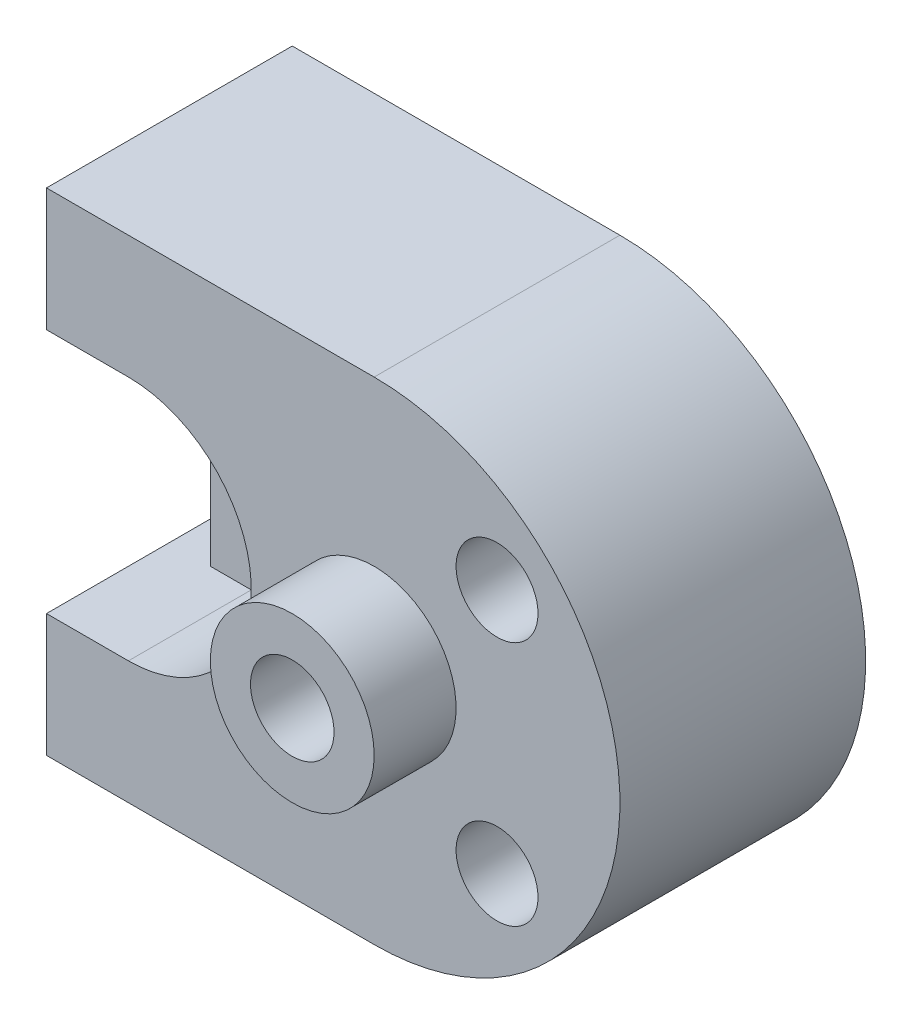
ISO-10303-21;
HEADER;
FILE_DESCRIPTION(('STEP AP214'),'2;1');
FILE_NAME('part.step','',(''),(''),'','','');
FILE_SCHEMA(('AUTOMOTIVE_DESIGN { 1 0 10303 214 1 1 1 1 }'));
ENDSEC;
DATA;
#1=APPLICATION_CONTEXT('core data for automotive mechanical design processes');
#2=APPLICATION_PROTOCOL_DEFINITION('international standard','automotive_design',2000,#1);
#3=PRODUCT_CONTEXT('',#1,'mechanical');
#4=PRODUCT('Part','Part','',(#3));
#5=PRODUCT_RELATED_PRODUCT_CATEGORY('part','',(#4));
#6=PRODUCT_DEFINITION_FORMATION('','',#4);
#7=PRODUCT_DEFINITION_CONTEXT('part definition',#1,'design');
#8=PRODUCT_DEFINITION('design','',#6,#7);
#9=PRODUCT_DEFINITION_SHAPE('','',#8);
#10=(LENGTH_UNIT() NAMED_UNIT(*) SI_UNIT(.MILLI.,.METRE.));
#11=(NAMED_UNIT(*) PLANE_ANGLE_UNIT() SI_UNIT($,.RADIAN.));
#12=(NAMED_UNIT(*) SI_UNIT($,.STERADIAN.) SOLID_ANGLE_UNIT());
#13=UNCERTAINTY_MEASURE_WITH_UNIT(LENGTH_MEASURE(1.E-05),#10,'distance_accuracy_value','');
#14=(GEOMETRIC_REPRESENTATION_CONTEXT(3) GLOBAL_UNCERTAINTY_ASSIGNED_CONTEXT((#13)) GLOBAL_UNIT_ASSIGNED_CONTEXT((#10,
#11,#12)) REPRESENTATION_CONTEXT('',''));
#15=CARTESIAN_POINT('',(0.,0.,0.));
#16=DIRECTION('',(0.,0.,1.));
#17=DIRECTION('',(1.,0.,0.));
#18=AXIS2_PLACEMENT_3D('',#15,#16,#17);
#19=CARTESIAN_POINT('',(0.,0.,30.));
#20=DIRECTION('',(0.,0.,-1.));
#21=DIRECTION('',(-1.,0.,0.));
#22=AXIS2_PLACEMENT_3D('',#19,#20,#21);
#23=PLANE('',#22);
#24=CARTESIAN_POINT('',(15.,-15.,30.));
#25=DIRECTION('',(0.,0.,1.));
#26=DIRECTION('',(1.,0.,0.));
#27=AXIS2_PLACEMENT_3D('',#24,#25,#26);
#28=CIRCLE('',#27,5.);
#29=CARTESIAN_POINT('',(20.,-15.,30.));
#30=VERTEX_POINT('',#29);
#31=EDGE_CURVE('E156',#30,#30,#28,.T.);
#32=ORIENTED_EDGE('',*,*,#31,.F.);
#33=EDGE_LOOP('',(#32));
#34=FACE_BOUND('',#33,.T.);
#35=CARTESIAN_POINT('',(15.,15.,30.));
#36=DIRECTION('',(0.,0.,1.));
#37=DIRECTION('',(1.,0.,0.));
#38=AXIS2_PLACEMENT_3D('',#35,#36,#37);
#39=CIRCLE('',#38,5.);
#40=CARTESIAN_POINT('',(20.,15.,30.));
#41=VERTEX_POINT('',#40);
#42=EDGE_CURVE('E160',#41,#41,#39,.T.);
#43=ORIENTED_EDGE('',*,*,#42,.F.);
#44=EDGE_LOOP('',(#43));
#45=FACE_BOUND('',#44,.T.);
#46=DIRECTION('',(1.,0.,0.));
#47=VECTOR('',#46,1.);
#48=CARTESIAN_POINT('',(-40.,15.,30.));
#49=LINE('',#48,#47);
#50=CARTESIAN_POINT('',(-40.,15.,30.));
#51=VERTEX_POINT('',#50);
#52=CARTESIAN_POINT('',(-30.,15.,30.));
#53=VERTEX_POINT('',#52);
#54=EDGE_CURVE('E209',#51,#53,#49,.T.);
#55=ORIENTED_EDGE('',*,*,#54,.T.);
#56=CARTESIAN_POINT('',(-30.,-1.7110534492634E-08,30.));
#57=DIRECTION('',(0.,0.,1.));
#58=DIRECTION('',(-1.,0.,0.));
#59=AXIS2_PLACEMENT_3D('',#56,#57,#58);
#60=CIRCLE('',#59,15.0000000171105);
#61=CARTESIAN_POINT('',(-29.9989867714367,-15.,30.));
#62=VERTEX_POINT('',#61);
#63=EDGE_CURVE('E177',#62,#53,#60,.T.);
#64=ORIENTED_EDGE('',*,*,#63,.F.);
#65=DIRECTION('',(-1.,0.,0.));
#66=VECTOR('',#65,1.);
#67=CARTESIAN_POINT('',(-30.,-15.,30.));
#68=LINE('',#67,#66);
#69=CARTESIAN_POINT('',(-40.,-15.,30.));
#70=VERTEX_POINT('',#69);
#71=EDGE_CURVE('E211',#62,#70,#68,.T.);
#72=ORIENTED_EDGE('',*,*,#71,.T.);
#73=DIRECTION('',(0.,-1.,0.));
#74=VECTOR('',#73,1.);
#75=CARTESIAN_POINT('',(-40.,-15.,30.));
#76=LINE('',#75,#74);
#77=CARTESIAN_POINT('',(-40.,-30.,30.));
#78=VERTEX_POINT('',#77);
#79=EDGE_CURVE('E213',#70,#78,#76,.T.);
#80=ORIENTED_EDGE('',*,*,#79,.T.);
#81=DIRECTION('',(1.,0.,0.));
#82=VECTOR('',#81,1.);
#83=CARTESIAN_POINT('',(-40.,-30.,30.));
#84=LINE('',#83,#82);
#85=CARTESIAN_POINT('',(0.,-30.,30.));
#86=VERTEX_POINT('',#85);
#87=EDGE_CURVE('E215',#78,#86,#84,.T.);
#88=ORIENTED_EDGE('',*,*,#87,.T.);
#89=CARTESIAN_POINT('',(0.,0.,30.));
#90=DIRECTION('',(0.,0.,1.));
#91=DIRECTION('',(-1.,0.,0.));
#92=AXIS2_PLACEMENT_3D('',#89,#90,#91);
#93=CIRCLE('',#92,30.);
#94=CARTESIAN_POINT('',(0.,30.,30.));
#95=VERTEX_POINT('',#94);
#96=EDGE_CURVE('E217',#86,#95,#93,.T.);
#97=ORIENTED_EDGE('',*,*,#96,.T.);
#98=DIRECTION('',(-1.,0.,0.));
#99=VECTOR('',#98,1.);
#100=CARTESIAN_POINT('',(-40.,30.,30.));
#101=LINE('',#100,#99);
#102=CARTESIAN_POINT('',(-40.,30.,30.));
#103=VERTEX_POINT('',#102);
#104=EDGE_CURVE('E203',#95,#103,#101,.T.);
#105=ORIENTED_EDGE('',*,*,#104,.T.);
#106=DIRECTION('',(0.,-1.,0.));
#107=VECTOR('',#106,1.);
#108=CARTESIAN_POINT('',(-40.,30.,30.));
#109=LINE('',#108,#107);
#110=EDGE_CURVE('E206',#103,#51,#109,.T.);
#111=ORIENTED_EDGE('',*,*,#110,.T.);
#112=EDGE_LOOP('',(#55,#64,#72,#80,#88,#97,#105,#111));
#113=FACE_BOUND('',#112,.T.);
#114=CARTESIAN_POINT('',(0.,0.,30.));
#115=DIRECTION('',(0.,0.,-1.));
#116=DIRECTION('',(-1.,0.,0.));
#117=AXIS2_PLACEMENT_3D('',#114,#115,#116);
#118=CIRCLE('',#117,10.);
#119=CARTESIAN_POINT('',(-10.,0.,30.));
#120=VERTEX_POINT('',#119);
#121=EDGE_CURVE('E11',#120,#120,#118,.F.);
#122=ORIENTED_EDGE('',*,*,#121,.F.);
#123=EDGE_LOOP('',(#122));
#124=FACE_BOUND('',#123,.T.);
#125=ADVANCED_FACE('F35',(#34,#45,#113,#124),#23,.F.);
#126=CARTESIAN_POINT('',(-40.,30.,30.));
#127=DIRECTION('',(0.,-1.,0.));
#128=DIRECTION('',(0.,0.,-1.));
#129=AXIS2_PLACEMENT_3D('',#126,#127,#128);
#130=PLANE('',#129);
#131=DIRECTION('',(-1.,0.,0.));
#132=VECTOR('',#131,1.);
#133=CARTESIAN_POINT('',(-40.,30.,0.));
#134=LINE('',#133,#132);
#135=CARTESIAN_POINT('',(0.,30.,0.));
#136=VERTEX_POINT('',#135);
#137=CARTESIAN_POINT('',(-40.,30.,0.));
#138=VERTEX_POINT('',#137);
#139=EDGE_CURVE('E201',#136,#138,#134,.T.);
#140=ORIENTED_EDGE('',*,*,#139,.T.);
#141=DIRECTION('',(0.,0.,-1.));
#142=VECTOR('',#141,1.);
#143=CARTESIAN_POINT('',(-40.,30.,30.));
#144=LINE('',#143,#142);
#145=EDGE_CURVE('E43',#103,#138,#144,.T.);
#146=ORIENTED_EDGE('',*,*,#145,.F.);
#147=ORIENTED_EDGE('',*,*,#104,.F.);
#148=DIRECTION('',(0.,0.,-1.));
#149=VECTOR('',#148,1.);
#150=CARTESIAN_POINT('',(0.,30.,30.));
#151=LINE('',#150,#149);
#152=EDGE_CURVE('E219',#95,#136,#151,.T.);
#153=ORIENTED_EDGE('',*,*,#152,.T.);
#154=EDGE_LOOP('',(#140,#146,#147,#153));
#155=FACE_BOUND('',#154,.T.);
#156=ADVANCED_FACE('F37',(#155),#130,.F.);
#157=CARTESIAN_POINT('',(-40.,30.,30.));
#158=DIRECTION('',(1.,0.,0.));
#159=DIRECTION('',(0.,1.,0.));
#160=AXIS2_PLACEMENT_3D('',#157,#158,#159);
#161=PLANE('',#160);
#162=DIRECTION('',(0.,-1.,0.));
#163=VECTOR('',#162,1.);
#164=CARTESIAN_POINT('',(-40.,30.,0.));
#165=LINE('',#164,#163);
#166=CARTESIAN_POINT('',(-40.,15.,0.));
#167=VERTEX_POINT('',#166);
#168=EDGE_CURVE('E222',#138,#167,#165,.T.);
#169=ORIENTED_EDGE('',*,*,#168,.T.);
#170=DIRECTION('',(0.,0.,-1.));
#171=VECTOR('',#170,1.);
#172=CARTESIAN_POINT('',(-40.,15.,30.));
#173=LINE('',#172,#171);
#174=EDGE_CURVE('E243',#51,#167,#173,.T.);
#175=ORIENTED_EDGE('',*,*,#174,.F.);
#176=ORIENTED_EDGE('',*,*,#110,.F.);
#177=ORIENTED_EDGE('',*,*,#145,.T.);
#178=EDGE_LOOP('',(#169,#175,#176,#177));
#179=FACE_BOUND('',#178,.T.);
#180=ADVANCED_FACE('F247',(#179),#161,.F.);
#181=CARTESIAN_POINT('',(-40.,15.,30.));
#182=DIRECTION('',(0.,1.,0.));
#183=DIRECTION('',(-1.,0.,0.));
#184=AXIS2_PLACEMENT_3D('',#181,#182,#183);
#185=PLANE('',#184);
#186=DIRECTION('',(1.,0.,0.));
#187=VECTOR('',#186,1.);
#188=CARTESIAN_POINT('',(-40.,15.,0.));
#189=LINE('',#188,#187);
#190=CARTESIAN_POINT('',(-35.,15.,0.));
#191=VERTEX_POINT('',#190);
#192=EDGE_CURVE('E58',#167,#191,#189,.T.);
#193=ORIENTED_EDGE('',*,*,#192,.T.);
#194=DIRECTION('',(0.,0.,1.));
#195=VECTOR('',#194,1.);
#196=CARTESIAN_POINT('',(-35.,15.,0.));
#197=LINE('',#196,#195);
#198=CARTESIAN_POINT('',(-35.,15.,15.));
#199=VERTEX_POINT('',#198);
#200=EDGE_CURVE('E197',#191,#199,#197,.T.);
#201=ORIENTED_EDGE('',*,*,#200,.T.);
#202=DIRECTION('',(-1.,0.,0.));
#203=VECTOR('',#202,1.);
#204=CARTESIAN_POINT('',(-35.,15.,15.));
#205=LINE('',#204,#203);
#206=CARTESIAN_POINT('',(-30.,15.,15.));
#207=VERTEX_POINT('',#206);
#208=EDGE_CURVE('E50',#207,#199,#205,.T.);
#209=ORIENTED_EDGE('',*,*,#208,.F.);
#210=DIRECTION('',(0.,0.,1.));
#211=VECTOR('',#210,1.);
#212=CARTESIAN_POINT('',(-30.,15.,15.));
#213=LINE('',#212,#211);
#214=EDGE_CURVE('E189',#207,#53,#213,.T.);
#215=ORIENTED_EDGE('',*,*,#214,.T.);
#216=ORIENTED_EDGE('',*,*,#54,.F.);
#217=ORIENTED_EDGE('',*,*,#174,.T.);
#218=EDGE_LOOP('',(#193,#201,#209,#215,#216,#217));
#219=FACE_BOUND('',#218,.T.);
#220=ADVANCED_FACE('F262',(#219),#185,.F.);
#221=CARTESIAN_POINT('',(-30.,-15.,30.));
#222=DIRECTION('',(0.,-1.,0.));
#223=DIRECTION('',(1.,0.,0.));
#224=AXIS2_PLACEMENT_3D('',#221,#222,#223);
#225=PLANE('',#224);
#226=ORIENTED_EDGE('',*,*,#71,.F.);
#227=DIRECTION('',(0.,0.,1.));
#228=VECTOR('',#227,1.);
#229=CARTESIAN_POINT('',(-29.9989867714367,-15.,15.));
#230=LINE('',#229,#228);
#231=CARTESIAN_POINT('',(-29.9989867714367,-15.,15.));
#232=VERTEX_POINT('',#231);
#233=EDGE_CURVE('E186',#232,#62,#230,.T.);
#234=ORIENTED_EDGE('',*,*,#233,.F.);
#235=DIRECTION('',(1.,0.,0.));
#236=VECTOR('',#235,1.);
#237=CARTESIAN_POINT('',(-35.,-15.,15.));
#238=LINE('',#237,#236);
#239=CARTESIAN_POINT('',(-35.,-15.,15.));
#240=VERTEX_POINT('',#239);
#241=EDGE_CURVE('E180',#240,#232,#238,.T.);
#242=ORIENTED_EDGE('',*,*,#241,.F.);
#243=DIRECTION('',(0.,0.,1.));
#244=VECTOR('',#243,1.);
#245=CARTESIAN_POINT('',(-35.,-15.,0.));
#246=LINE('',#245,#244);
#247=CARTESIAN_POINT('',(-35.,-15.,0.));
#248=VERTEX_POINT('',#247);
#249=EDGE_CURVE('E198',#248,#240,#246,.T.);
#250=ORIENTED_EDGE('',*,*,#249,.F.);
#251=DIRECTION('',(-1.,0.,0.));
#252=VECTOR('',#251,1.);
#253=CARTESIAN_POINT('',(-30.,-15.,0.));
#254=LINE('',#253,#252);
#255=CARTESIAN_POINT('',(-40.,-15.,0.));
#256=VERTEX_POINT('',#255);
#257=EDGE_CURVE('E225',#248,#256,#254,.T.);
#258=ORIENTED_EDGE('',*,*,#257,.T.);
#259=DIRECTION('',(0.,0.,-1.));
#260=VECTOR('',#259,1.);
#261=CARTESIAN_POINT('',(-40.,-15.,30.));
#262=LINE('',#261,#260);
#263=EDGE_CURVE('E240',#70,#256,#262,.T.);
#264=ORIENTED_EDGE('',*,*,#263,.F.);
#265=EDGE_LOOP('',(#226,#234,#242,#250,#258,#264));
#266=FACE_BOUND('',#265,.T.);
#267=ADVANCED_FACE('F283',(#266),#225,.F.);
#268=CARTESIAN_POINT('',(-40.,-15.,30.));
#269=DIRECTION('',(1.,0.,0.));
#270=DIRECTION('',(0.,1.,0.));
#271=AXIS2_PLACEMENT_3D('',#268,#269,#270);
#272=PLANE('',#271);
#273=DIRECTION('',(0.,-1.,0.));
#274=VECTOR('',#273,1.);
#275=CARTESIAN_POINT('',(-40.,-15.,0.));
#276=LINE('',#275,#274);
#277=CARTESIAN_POINT('',(-40.,-30.,0.));
#278=VERTEX_POINT('',#277);
#279=EDGE_CURVE('E227',#256,#278,#276,.T.);
#280=ORIENTED_EDGE('',*,*,#279,.T.);
#281=DIRECTION('',(0.,0.,-1.));
#282=VECTOR('',#281,1.);
#283=CARTESIAN_POINT('',(-40.,-30.,30.));
#284=LINE('',#283,#282);
#285=EDGE_CURVE('E237',#78,#278,#284,.T.);
#286=ORIENTED_EDGE('',*,*,#285,.F.);
#287=ORIENTED_EDGE('',*,*,#79,.F.);
#288=ORIENTED_EDGE('',*,*,#263,.T.);
#289=EDGE_LOOP('',(#280,#286,#287,#288));
#290=FACE_BOUND('',#289,.T.);
#291=ADVANCED_FACE('F280',(#290),#272,.F.);
#292=CARTESIAN_POINT('',(-40.,-30.,30.));
#293=DIRECTION('',(0.,1.,0.));
#294=DIRECTION('',(0.,0.,1.));
#295=AXIS2_PLACEMENT_3D('',#292,#293,#294);
#296=PLANE('',#295);
#297=DIRECTION('',(1.,0.,0.));
#298=VECTOR('',#297,1.);
#299=CARTESIAN_POINT('',(-40.,-30.,0.));
#300=LINE('',#299,#298);
#301=CARTESIAN_POINT('',(0.,-30.,0.));
#302=VERTEX_POINT('',#301);
#303=EDGE_CURVE('E229',#278,#302,#300,.T.);
#304=ORIENTED_EDGE('',*,*,#303,.T.);
#305=DIRECTION('',(0.,0.,-1.));
#306=VECTOR('',#305,1.);
#307=CARTESIAN_POINT('',(0.,-30.,30.));
#308=LINE('',#307,#306);
#309=EDGE_CURVE('E234',#86,#302,#308,.T.);
#310=ORIENTED_EDGE('',*,*,#309,.F.);
#311=ORIENTED_EDGE('',*,*,#87,.F.);
#312=ORIENTED_EDGE('',*,*,#285,.T.);
#313=EDGE_LOOP('',(#304,#310,#311,#312));
#314=FACE_BOUND('',#313,.T.);
#315=ADVANCED_FACE('F277',(#314),#296,.F.);
#316=CARTESIAN_POINT('',(0.,0.,30.));
#317=DIRECTION('',(0.,0.,-1.));
#318=DIRECTION('',(-1.,0.,0.));
#319=AXIS2_PLACEMENT_3D('',#316,#317,#318);
#320=CYLINDRICAL_SURFACE('',#319,30.);
#321=CARTESIAN_POINT('',(0.,0.,0.));
#322=DIRECTION('',(0.,0.,1.));
#323=DIRECTION('',(-1.,0.,0.));
#324=AXIS2_PLACEMENT_3D('',#321,#322,#323);
#325=CIRCLE('',#324,30.);
#326=EDGE_CURVE('E207',#302,#136,#325,.T.);
#327=ORIENTED_EDGE('',*,*,#326,.T.);
#328=ORIENTED_EDGE('',*,*,#152,.F.);
#329=ORIENTED_EDGE('',*,*,#96,.F.);
#330=ORIENTED_EDGE('',*,*,#309,.T.);
#331=EDGE_LOOP('',(#327,#328,#329,#330));
#332=FACE_BOUND('',#331,.T.);
#333=ADVANCED_FACE('F275',(#332),#320,.T.);
#334=CARTESIAN_POINT('',(0.,0.,0.));
#335=DIRECTION('',(0.,0.,-1.));
#336=DIRECTION('',(-1.,0.,0.));
#337=AXIS2_PLACEMENT_3D('',#334,#335,#336);
#338=PLANE('',#337);
#339=CARTESIAN_POINT('',(15.,15.,0.));
#340=DIRECTION('',(0.,0.,-1.));
#341=DIRECTION('',(-1.,0.,0.));
#342=AXIS2_PLACEMENT_3D('',#339,#340,#341);
#343=CIRCLE('',#342,5.);
#344=CARTESIAN_POINT('',(10.,15.,0.));
#345=VERTEX_POINT('',#344);
#346=EDGE_CURVE('E140',#345,#345,#343,.T.);
#347=ORIENTED_EDGE('',*,*,#346,.F.);
#348=EDGE_LOOP('',(#347));
#349=FACE_BOUND('',#348,.T.);
#350=CARTESIAN_POINT('',(15.,-15.,0.));
#351=DIRECTION('',(0.,0.,-1.));
#352=DIRECTION('',(-1.,0.,0.));
#353=AXIS2_PLACEMENT_3D('',#350,#351,#352);
#354=CIRCLE('',#353,5.);
#355=CARTESIAN_POINT('',(10.,-15.,0.));
#356=VERTEX_POINT('',#355);
#357=EDGE_CURVE('E127',#356,#356,#354,.T.);
#358=ORIENTED_EDGE('',*,*,#357,.F.);
#359=EDGE_LOOP('',(#358));
#360=FACE_BOUND('',#359,.T.);
#361=CARTESIAN_POINT('',(-25.,0.,0.));
#362=DIRECTION('',(0.,0.,-1.));
#363=DIRECTION('',(-1.,0.,0.));
#364=AXIS2_PLACEMENT_3D('',#361,#362,#363);
#365=CIRCLE('',#364,5.);
#366=CARTESIAN_POINT('',(-30.,0.,0.));
#367=VERTEX_POINT('',#366);
#368=EDGE_CURVE('E174',#367,#367,#365,.T.);
#369=ORIENTED_EDGE('',*,*,#368,.F.);
#370=EDGE_LOOP('',(#369));
#371=FACE_BOUND('',#370,.T.);
#372=ORIENTED_EDGE('',*,*,#257,.F.);
#373=DIRECTION('',(0.,-1.,0.));
#374=VECTOR('',#373,1.);
#375=CARTESIAN_POINT('',(-35.,-15.,0.));
#376=LINE('',#375,#374);
#377=EDGE_CURVE('E192',#191,#248,#376,.T.);
#378=ORIENTED_EDGE('',*,*,#377,.F.);
#379=ORIENTED_EDGE('',*,*,#192,.F.);
#380=ORIENTED_EDGE('',*,*,#168,.F.);
#381=ORIENTED_EDGE('',*,*,#139,.F.);
#382=ORIENTED_EDGE('',*,*,#326,.F.);
#383=ORIENTED_EDGE('',*,*,#303,.F.);
#384=ORIENTED_EDGE('',*,*,#279,.F.);
#385=EDGE_LOOP('',(#372,#378,#379,#380,#381,#382,#383,#384));
#386=FACE_BOUND('',#385,.T.);
#387=ADVANCED_FACE('F256',(#349,#360,#371,#386),#338,.T.);
#388=CARTESIAN_POINT('',(-35.,-15.,0.));
#389=DIRECTION('',(-1.,0.,0.));
#390=DIRECTION('',(0.,0.,1.));
#391=AXIS2_PLACEMENT_3D('',#388,#389,#390);
#392=PLANE('',#391);
#393=DIRECTION('',(0.,-1.,0.));
#394=VECTOR('',#393,1.);
#395=CARTESIAN_POINT('',(-35.,-15.,15.));
#396=LINE('',#395,#394);
#397=EDGE_CURVE('E178',#199,#240,#396,.T.);
#398=ORIENTED_EDGE('',*,*,#397,.F.);
#399=ORIENTED_EDGE('',*,*,#200,.F.);
#400=ORIENTED_EDGE('',*,*,#377,.T.);
#401=ORIENTED_EDGE('',*,*,#249,.T.);
#402=EDGE_LOOP('',(#398,#399,#400,#401));
#403=FACE_BOUND('',#402,.T.);
#404=ADVANCED_FACE('F261',(#403),#392,.T.);
#405=CARTESIAN_POINT('',(-30.,-1.7110534492634E-08,15.));
#406=DIRECTION('',(0.,0.,1.));
#407=DIRECTION('',(1.,0.,0.));
#408=AXIS2_PLACEMENT_3D('',#405,#406,#407);
#409=CYLINDRICAL_SURFACE('',#408,15.0000000171105);
#410=ORIENTED_EDGE('',*,*,#63,.T.);
#411=ORIENTED_EDGE('',*,*,#214,.F.);
#412=CARTESIAN_POINT('',(-30.,-1.7110534492634E-08,15.));
#413=DIRECTION('',(0.,0.,1.));
#414=DIRECTION('',(-1.,0.,0.));
#415=AXIS2_PLACEMENT_3D('',#412,#413,#414);
#416=CIRCLE('',#415,15.0000000171105);
#417=EDGE_CURVE('E183',#232,#207,#416,.T.);
#418=ORIENTED_EDGE('',*,*,#417,.F.);
#419=ORIENTED_EDGE('',*,*,#233,.T.);
#420=EDGE_LOOP('',(#410,#411,#418,#419));
#421=FACE_BOUND('',#420,.T.);
#422=ADVANCED_FACE('F267',(#421),#409,.F.);
#423=CARTESIAN_POINT('',(-30.,-1.7110534492634E-08,15.));
#424=DIRECTION('',(0.,0.,-1.));
#425=DIRECTION('',(-1.,0.,0.));
#426=AXIS2_PLACEMENT_3D('',#423,#424,#425);
#427=PLANE('',#426);
#428=CARTESIAN_POINT('',(-25.,0.,15.));
#429=DIRECTION('',(0.,0.,1.));
#430=DIRECTION('',(1.,0.,0.));
#431=AXIS2_PLACEMENT_3D('',#428,#429,#430);
#432=CIRCLE('',#431,5.);
#433=CARTESIAN_POINT('',(-20.,0.,15.));
#434=VERTEX_POINT('',#433);
#435=EDGE_CURVE('E171',#434,#434,#432,.T.);
#436=ORIENTED_EDGE('',*,*,#435,.F.);
#437=EDGE_LOOP('',(#436));
#438=FACE_BOUND('',#437,.T.);
#439=ORIENTED_EDGE('',*,*,#397,.T.);
#440=ORIENTED_EDGE('',*,*,#241,.T.);
#441=ORIENTED_EDGE('',*,*,#417,.T.);
#442=ORIENTED_EDGE('',*,*,#208,.T.);
#443=EDGE_LOOP('',(#439,#440,#441,#442));
#444=FACE_BOUND('',#443,.T.);
#445=ADVANCED_FACE('F284',(#438,#444),#427,.F.);
#446=CARTESIAN_POINT('',(-25.,0.,-20.));
#447=DIRECTION('',(0.,0.,1.));
#448=DIRECTION('',(1.,0.,0.));
#449=AXIS2_PLACEMENT_3D('',#446,#447,#448);
#450=CYLINDRICAL_SURFACE('',#449,5.);
#451=ORIENTED_EDGE('',*,*,#368,.T.);
#452=EDGE_LOOP('',(#451));
#453=FACE_BOUND('',#452,.T.);
#454=ORIENTED_EDGE('',*,*,#435,.T.);
#455=EDGE_LOOP('',(#454));
#456=FACE_BOUND('',#455,.T.);
#457=ADVANCED_FACE('F286',(#453,#456),#450,.F.);
#458=CARTESIAN_POINT('',(0.,0.,40.));
#459=DIRECTION('',(0.,0.,-1.));
#460=DIRECTION('',(-1.,0.,0.));
#461=AXIS2_PLACEMENT_3D('',#458,#459,#460);
#462=CYLINDRICAL_SURFACE('',#461,10.);
#463=CARTESIAN_POINT('',(0.,0.,40.));
#464=DIRECTION('',(0.,0.,1.));
#465=DIRECTION('',(1.,0.,0.));
#466=AXIS2_PLACEMENT_3D('',#463,#464,#465);
#467=CIRCLE('',#466,10.);
#468=CARTESIAN_POINT('',(10.,0.,40.));
#469=VERTEX_POINT('',#468);
#470=EDGE_CURVE('E166',#469,#469,#467,.T.);
#471=ORIENTED_EDGE('',*,*,#470,.F.);
#472=EDGE_LOOP('',(#471));
#473=FACE_BOUND('',#472,.T.);
#474=ORIENTED_EDGE('',*,*,#121,.T.);
#475=EDGE_LOOP('',(#474));
#476=FACE_BOUND('',#475,.T.);
#477=ADVANCED_FACE('F293',(#473,#476),#462,.T.);
#478=CARTESIAN_POINT('',(0.,0.,40.));
#479=DIRECTION('',(0.,0.,1.));
#480=DIRECTION('',(1.,0.,0.));
#481=AXIS2_PLACEMENT_3D('',#478,#479,#480);
#482=PLANE('',#481);
#483=CARTESIAN_POINT('',(0.,0.,40.));
#484=DIRECTION('',(0.,0.,1.));
#485=DIRECTION('',(1.,0.,0.));
#486=AXIS2_PLACEMENT_3D('',#483,#484,#485);
#487=CIRCLE('',#486,5.1);
#488=CARTESIAN_POINT('',(5.1,0.,40.));
#489=VERTEX_POINT('',#488);
#490=EDGE_CURVE('E128',#489,#489,#487,.T.);
#491=ORIENTED_EDGE('',*,*,#490,.F.);
#492=EDGE_LOOP('',(#491));
#493=FACE_BOUND('',#492,.T.);
#494=ORIENTED_EDGE('',*,*,#470,.T.);
#495=EDGE_LOOP('',(#494));
#496=FACE_BOUND('',#495,.T.);
#497=ADVANCED_FACE('F379',(#493,#496),#482,.T.);
#498=CARTESIAN_POINT('',(15.,15.,20.));
#499=DIRECTION('',(0.,0.,1.));
#500=DIRECTION('',(1.,0.,0.));
#501=AXIS2_PLACEMENT_3D('',#498,#499,#500);
#502=CYLINDRICAL_SURFACE('',#501,5.);
#503=CARTESIAN_POINT('',(15.,15.,20.));
#504=DIRECTION('',(0.,0.,1.));
#505=DIRECTION('',(1.,0.,0.));
#506=AXIS2_PLACEMENT_3D('',#503,#504,#505);
#507=CIRCLE('',#506,5.);
#508=CARTESIAN_POINT('',(20.,15.,20.));
#509=VERTEX_POINT('',#508);
#510=EDGE_CURVE('E163',#509,#509,#507,.T.);
#511=ORIENTED_EDGE('',*,*,#510,.F.);
#512=EDGE_LOOP('',(#511));
#513=FACE_BOUND('',#512,.T.);
#514=ORIENTED_EDGE('',*,*,#42,.T.);
#515=EDGE_LOOP('',(#514));
#516=FACE_BOUND('',#515,.T.);
#517=ADVANCED_FACE('F392',(#513,#516),#502,.F.);
#518=CARTESIAN_POINT('',(15.,15.,20.));
#519=DIRECTION('',(0.,0.,1.));
#520=DIRECTION('',(1.,0.,0.));
#521=AXIS2_PLACEMENT_3D('',#518,#519,#520);
#522=PLANE('',#521);
#523=CARTESIAN_POINT('',(15.,15.,20.));
#524=DIRECTION('',(0.,0.,1.));
#525=DIRECTION('',(1.,0.,0.));
#526=AXIS2_PLACEMENT_3D('',#523,#524,#525);
#527=CIRCLE('',#526,2.5);
#528=CARTESIAN_POINT('',(17.5,15.,20.));
#529=VERTEX_POINT('',#528);
#530=EDGE_CURVE('E151',#529,#529,#527,.T.);
#531=ORIENTED_EDGE('',*,*,#530,.F.);
#532=EDGE_LOOP('',(#531));
#533=FACE_BOUND('',#532,.T.);
#534=ORIENTED_EDGE('',*,*,#510,.T.);
#535=EDGE_LOOP('',(#534));
#536=FACE_BOUND('',#535,.T.);
#537=ADVANCED_FACE('F397',(#533,#536),#522,.T.);
#538=CARTESIAN_POINT('',(15.,-15.,20.));
#539=DIRECTION('',(0.,0.,1.));
#540=DIRECTION('',(1.,0.,0.));
#541=AXIS2_PLACEMENT_3D('',#538,#539,#540);
#542=CYLINDRICAL_SURFACE('',#541,5.);
#543=CARTESIAN_POINT('',(15.,-15.,20.));
#544=DIRECTION('',(0.,0.,1.));
#545=DIRECTION('',(1.,0.,0.));
#546=AXIS2_PLACEMENT_3D('',#543,#544,#545);
#547=CIRCLE('',#546,5.);
#548=CARTESIAN_POINT('',(20.,-15.,20.));
#549=VERTEX_POINT('',#548);
#550=EDGE_CURVE('E157',#549,#549,#547,.T.);
#551=ORIENTED_EDGE('',*,*,#550,.F.);
#552=EDGE_LOOP('',(#551));
#553=FACE_BOUND('',#552,.T.);
#554=ORIENTED_EDGE('',*,*,#31,.T.);
#555=EDGE_LOOP('',(#554));
#556=FACE_BOUND('',#555,.T.);
#557=ADVANCED_FACE('F405',(#553,#556),#542,.F.);
#558=CARTESIAN_POINT('',(15.,-15.,20.));
#559=DIRECTION('',(0.,0.,1.));
#560=DIRECTION('',(1.,0.,0.));
#561=AXIS2_PLACEMENT_3D('',#558,#559,#560);
#562=PLANE('',#561);
#563=CARTESIAN_POINT('',(15.,-15.,20.));
#564=DIRECTION('',(0.,0.,1.));
#565=DIRECTION('',(1.,0.,0.));
#566=AXIS2_PLACEMENT_3D('',#563,#564,#565);
#567=CIRCLE('',#566,2.5);
#568=CARTESIAN_POINT('',(17.5,-15.,20.));
#569=VERTEX_POINT('',#568);
#570=EDGE_CURVE('E148',#569,#569,#567,.T.);
#571=ORIENTED_EDGE('',*,*,#570,.F.);
#572=EDGE_LOOP('',(#571));
#573=FACE_BOUND('',#572,.T.);
#574=ORIENTED_EDGE('',*,*,#550,.T.);
#575=EDGE_LOOP('',(#574));
#576=FACE_BOUND('',#575,.T.);
#577=ADVANCED_FACE('F410',(#573,#576),#562,.T.);
#578=CARTESIAN_POINT('',(15.,15.,10.));
#579=DIRECTION('',(0.,0.,1.));
#580=DIRECTION('',(1.,0.,0.));
#581=AXIS2_PLACEMENT_3D('',#578,#579,#580);
#582=CYLINDRICAL_SURFACE('',#581,2.5);
#583=CARTESIAN_POINT('',(15.,15.,10.));
#584=DIRECTION('',(0.,0.,1.));
#585=DIRECTION('',(1.,0.,0.));
#586=AXIS2_PLACEMENT_3D('',#583,#584,#585);
#587=CIRCLE('',#586,2.5);
#588=CARTESIAN_POINT('',(17.5,15.,10.));
#589=VERTEX_POINT('',#588);
#590=EDGE_CURVE('E147',#589,#589,#587,.T.);
#591=ORIENTED_EDGE('',*,*,#590,.F.);
#592=EDGE_LOOP('',(#591));
#593=FACE_BOUND('',#592,.T.);
#594=ORIENTED_EDGE('',*,*,#530,.T.);
#595=EDGE_LOOP('',(#594));
#596=FACE_BOUND('',#595,.T.);
#597=ADVANCED_FACE('F427',(#593,#596),#582,.F.);
#598=CARTESIAN_POINT('',(15.,-15.,10.));
#599=DIRECTION('',(0.,0.,1.));
#600=DIRECTION('',(1.,0.,0.));
#601=AXIS2_PLACEMENT_3D('',#598,#599,#600);
#602=CYLINDRICAL_SURFACE('',#601,2.5);
#603=CARTESIAN_POINT('',(15.,-15.,10.));
#604=DIRECTION('',(0.,0.,1.));
#605=DIRECTION('',(1.,0.,0.));
#606=AXIS2_PLACEMENT_3D('',#603,#604,#605);
#607=CIRCLE('',#606,2.5);
#608=CARTESIAN_POINT('',(17.5,-15.,10.));
#609=VERTEX_POINT('',#608);
#610=EDGE_CURVE('E139',#609,#609,#607,.T.);
#611=ORIENTED_EDGE('',*,*,#610,.F.);
#612=EDGE_LOOP('',(#611));
#613=FACE_BOUND('',#612,.T.);
#614=ORIENTED_EDGE('',*,*,#570,.T.);
#615=EDGE_LOOP('',(#614));
#616=FACE_BOUND('',#615,.T.);
#617=ADVANCED_FACE('F436',(#613,#616),#602,.F.);
#618=CARTESIAN_POINT('',(15.,-15.,10.));
#619=DIRECTION('',(0.,0.,-1.));
#620=DIRECTION('',(-1.,0.,0.));
#621=AXIS2_PLACEMENT_3D('',#618,#619,#620);
#622=PLANE('',#621);
#623=CARTESIAN_POINT('',(15.,-15.,10.));
#624=DIRECTION('',(0.,0.,-1.));
#625=DIRECTION('',(-1.,0.,0.));
#626=AXIS2_PLACEMENT_3D('',#623,#624,#625);
#627=CIRCLE('',#626,5.);
#628=CARTESIAN_POINT('',(10.,-15.,10.));
#629=VERTEX_POINT('',#628);
#630=EDGE_CURVE('E131',#629,#629,#627,.T.);
#631=ORIENTED_EDGE('',*,*,#630,.T.);
#632=EDGE_LOOP('',(#631));
#633=FACE_BOUND('',#632,.T.);
#634=ORIENTED_EDGE('',*,*,#610,.T.);
#635=EDGE_LOOP('',(#634));
#636=FACE_BOUND('',#635,.T.);
#637=ADVANCED_FACE('F445',(#633,#636),#622,.T.);
#638=CARTESIAN_POINT('',(15.,-15.,10.));
#639=DIRECTION('',(0.,0.,-1.));
#640=DIRECTION('',(-1.,0.,0.));
#641=AXIS2_PLACEMENT_3D('',#638,#639,#640);
#642=CYLINDRICAL_SURFACE('',#641,5.);
#643=ORIENTED_EDGE('',*,*,#630,.F.);
#644=EDGE_LOOP('',(#643));
#645=FACE_BOUND('',#644,.T.);
#646=ORIENTED_EDGE('',*,*,#357,.T.);
#647=EDGE_LOOP('',(#646));
#648=FACE_BOUND('',#647,.T.);
#649=ADVANCED_FACE('F455',(#645,#648),#642,.F.);
#650=CARTESIAN_POINT('',(15.,15.,10.));
#651=DIRECTION('',(0.,0.,-1.));
#652=DIRECTION('',(-1.,0.,0.));
#653=AXIS2_PLACEMENT_3D('',#650,#651,#652);
#654=PLANE('',#653);
#655=CARTESIAN_POINT('',(15.,15.,10.));
#656=DIRECTION('',(0.,0.,-1.));
#657=DIRECTION('',(-1.,0.,0.));
#658=AXIS2_PLACEMENT_3D('',#655,#656,#657);
#659=CIRCLE('',#658,5.);
#660=CARTESIAN_POINT('',(10.,15.,10.));
#661=VERTEX_POINT('',#660);
#662=EDGE_CURVE('E136',#661,#661,#659,.T.);
#663=ORIENTED_EDGE('',*,*,#662,.T.);
#664=EDGE_LOOP('',(#663));
#665=FACE_BOUND('',#664,.T.);
#666=ORIENTED_EDGE('',*,*,#590,.T.);
#667=EDGE_LOOP('',(#666));
#668=FACE_BOUND('',#667,.T.);
#669=ADVANCED_FACE('F462',(#665,#668),#654,.T.);
#670=CARTESIAN_POINT('',(15.,15.,10.));
#671=DIRECTION('',(0.,0.,-1.));
#672=DIRECTION('',(-1.,0.,0.));
#673=AXIS2_PLACEMENT_3D('',#670,#671,#672);
#674=CYLINDRICAL_SURFACE('',#673,5.);
#675=ORIENTED_EDGE('',*,*,#662,.F.);
#676=EDGE_LOOP('',(#675));
#677=FACE_BOUND('',#676,.T.);
#678=ORIENTED_EDGE('',*,*,#346,.T.);
#679=EDGE_LOOP('',(#678));
#680=FACE_BOUND('',#679,.T.);
#681=ADVANCED_FACE('F121',(#677,#680),#674,.F.);
#682=CARTESIAN_POINT('',(0.,0.,25.));
#683=DIRECTION('',(0.,0.,1.));
#684=DIRECTION('',(1.,0.,0.));
#685=AXIS2_PLACEMENT_3D('',#682,#683,#684);
#686=CONICAL_SURFACE('',#685,5.1,1.02974425867665);
#687=CARTESIAN_POINT('',(0.,0.,21.9356108429594));
#688=VERTEX_POINT('',#687);
#689=VERTEX_LOOP('',#688);
#690=FACE_BOUND('',#689,.T.);
#691=CARTESIAN_POINT('',(0.,0.,25.));
#692=DIRECTION('',(0.,0.,1.));
#693=DIRECTION('',(1.,0.,0.));
#694=AXIS2_PLACEMENT_3D('',#691,#692,#693);
#695=CIRCLE('',#694,5.1);
#696=CARTESIAN_POINT('',(5.1,0.,25.));
#697=VERTEX_POINT('',#696);
#698=EDGE_CURVE('E125',#697,#697,#695,.T.);
#699=ORIENTED_EDGE('',*,*,#698,.T.);
#700=EDGE_LOOP('',(#699));
#701=FACE_BOUND('',#700,.T.);
#702=ADVANCED_FACE('F117',(#690,#701),#686,.F.);
#703=CARTESIAN_POINT('',(0.,0.,40.));
#704=DIRECTION('',(0.,0.,1.));
#705=DIRECTION('',(1.,0.,0.));
#706=AXIS2_PLACEMENT_3D('',#703,#704,#705);
#707=CYLINDRICAL_SURFACE('',#706,5.1);
#708=ORIENTED_EDGE('',*,*,#698,.F.);
#709=EDGE_LOOP('',(#708));
#710=FACE_BOUND('',#709,.T.);
#711=ORIENTED_EDGE('',*,*,#490,.T.);
#712=EDGE_LOOP('',(#711));
#713=FACE_BOUND('',#712,.T.);
#714=ADVANCED_FACE('F120',(#710,#713),#707,.F.);
#715=CLOSED_SHELL('',(#125,#156,#180,#220,#267,#291,#315,#333,#387,#404,#422,#445,#457,#477,
#497,#517,#537,#557,#577,#597,#617,#637,#649,#669,#681,#702,#714));
#716=MANIFOLD_SOLID_BREP('B2',#715);
#717=ADVANCED_BREP_SHAPE_REPRESENTATION('',(#18,#716),#14);
#718=SHAPE_DEFINITION_REPRESENTATION(#9,#717);
ENDSEC;
END-ISO-10303-21;
